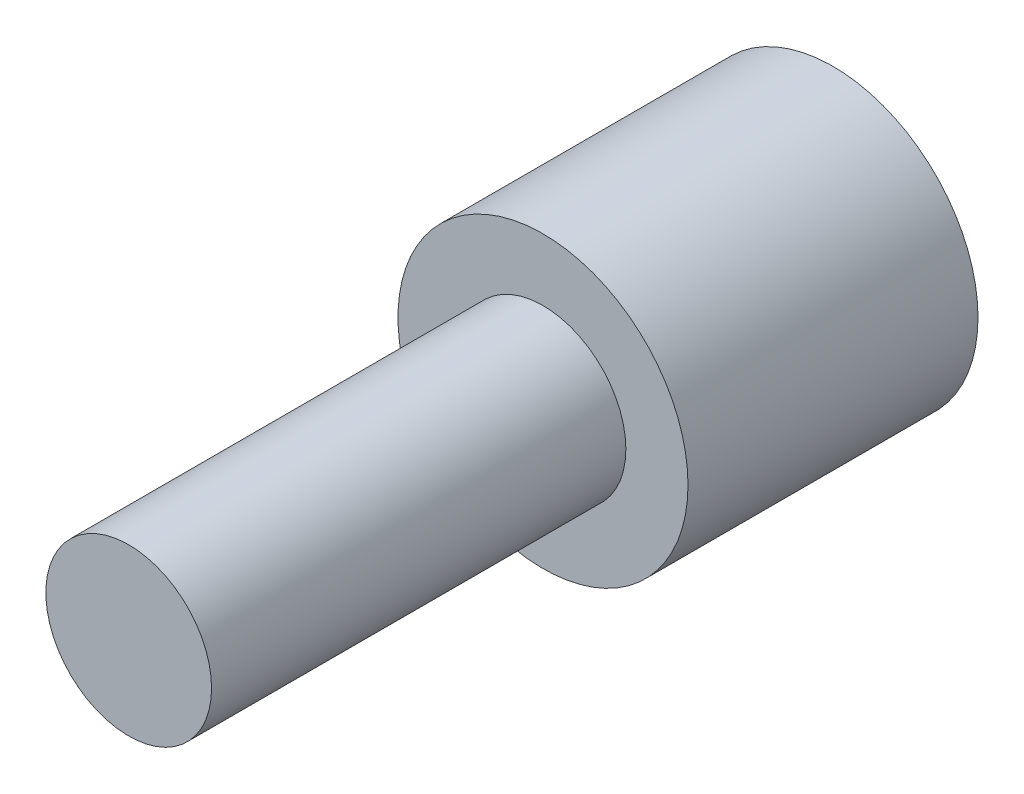
ISO-10303-21;
HEADER;
FILE_DESCRIPTION(('STEP AP214'),'2;1');
FILE_NAME('part.step','',(''),(''),'','','');
FILE_SCHEMA(('AUTOMOTIVE_DESIGN { 1 0 10303 214 1 1 1 1 }'));
ENDSEC;
DATA;
#1=APPLICATION_CONTEXT('core data for automotive mechanical design processes');
#2=APPLICATION_PROTOCOL_DEFINITION('international standard','automotive_design',2000,#1);
#3=PRODUCT_CONTEXT('',#1,'mechanical');
#4=PRODUCT('Part','Part','',(#3));
#5=PRODUCT_RELATED_PRODUCT_CATEGORY('part','',(#4));
#6=PRODUCT_DEFINITION_FORMATION('','',#4);
#7=PRODUCT_DEFINITION_CONTEXT('part definition',#1,'design');
#8=PRODUCT_DEFINITION('design','',#6,#7);
#9=PRODUCT_DEFINITION_SHAPE('','',#8);
#10=(LENGTH_UNIT() NAMED_UNIT(*) SI_UNIT(.MILLI.,.METRE.));
#11=(NAMED_UNIT(*) PLANE_ANGLE_UNIT() SI_UNIT($,.RADIAN.));
#12=(NAMED_UNIT(*) SI_UNIT($,.STERADIAN.) SOLID_ANGLE_UNIT());
#13=UNCERTAINTY_MEASURE_WITH_UNIT(LENGTH_MEASURE(1.E-05),#10,'distance_accuracy_value','');
#14=(GEOMETRIC_REPRESENTATION_CONTEXT(3) GLOBAL_UNCERTAINTY_ASSIGNED_CONTEXT((#13)) GLOBAL_UNIT_ASSIGNED_CONTEXT((#10,
#11,#12)) REPRESENTATION_CONTEXT('',''));
#15=CARTESIAN_POINT('',(0.,0.,0.));
#16=DIRECTION('',(0.,0.,1.));
#17=DIRECTION('',(1.,0.,0.));
#18=AXIS2_PLACEMENT_3D('',#15,#16,#17);
#19=CARTESIAN_POINT('',(0.,0.,7.));
#20=DIRECTION('',(0.,0.,-1.));
#21=DIRECTION('',(-1.,0.,0.));
#22=AXIS2_PLACEMENT_3D('',#19,#20,#21);
#23=CYLINDRICAL_SURFACE('',#22,3.5);
#24=CARTESIAN_POINT('',(0.,0.,7.));
#25=DIRECTION('',(0.,0.,1.));
#26=DIRECTION('',(1.,0.,0.));
#27=AXIS2_PLACEMENT_3D('',#24,#25,#26);
#28=CIRCLE('',#27,3.5);
#29=CARTESIAN_POINT('',(3.5,0.,7.));
#30=VERTEX_POINT('',#29);
#31=EDGE_CURVE('E45',#30,#30,#28,.T.);
#32=ORIENTED_EDGE('',*,*,#31,.F.);
#33=EDGE_LOOP('',(#32));
#34=FACE_BOUND('',#33,.T.);
#35=CARTESIAN_POINT('',(0.,0.,0.));
#36=DIRECTION('',(0.,0.,1.));
#37=DIRECTION('',(1.,0.,0.));
#38=AXIS2_PLACEMENT_3D('',#35,#36,#37);
#39=CIRCLE('',#38,3.5);
#40=CARTESIAN_POINT('',(3.5,0.,0.));
#41=VERTEX_POINT('',#40);
#42=EDGE_CURVE('E40',#41,#41,#39,.T.);
#43=ORIENTED_EDGE('',*,*,#42,.T.);
#44=EDGE_LOOP('',(#43));
#45=FACE_BOUND('',#44,.T.);
#46=ADVANCED_FACE('F37',(#34,#45),#23,.T.);
#47=CARTESIAN_POINT('',(0.,0.,7.));
#48=DIRECTION('',(0.,0.,1.));
#49=DIRECTION('',(1.,0.,0.));
#50=AXIS2_PLACEMENT_3D('',#47,#48,#49);
#51=PLANE('',#50);
#52=CARTESIAN_POINT('',(0.,0.,7.));
#53=DIRECTION('',(0.,0.,1.));
#54=DIRECTION('',(1.,0.,0.));
#55=AXIS2_PLACEMENT_3D('',#52,#53,#54);
#56=CIRCLE('',#55,2.);
#57=CARTESIAN_POINT('',(2.,0.,7.));
#58=VERTEX_POINT('',#57);
#59=EDGE_CURVE('E10',#58,#58,#56,.T.);
#60=ORIENTED_EDGE('',*,*,#59,.F.);
#61=EDGE_LOOP('',(#60));
#62=FACE_BOUND('',#61,.T.);
#63=ORIENTED_EDGE('',*,*,#31,.T.);
#64=EDGE_LOOP('',(#63));
#65=FACE_BOUND('',#64,.T.);
#66=ADVANCED_FACE('F82',(#62,#65),#51,.T.);
#67=CARTESIAN_POINT('',(0.,0.,0.));
#68=DIRECTION('',(0.,0.,1.));
#69=DIRECTION('',(1.,0.,0.));
#70=AXIS2_PLACEMENT_3D('',#67,#68,#69);
#71=PLANE('',#70);
#72=CARTESIAN_POINT('',(0.,0.,0.));
#73=DIRECTION('',(0.,0.,-1.));
#74=DIRECTION('',(-1.,0.,0.));
#75=AXIS2_PLACEMENT_3D('',#72,#73,#74);
#76=CIRCLE('',#75,2.9);
#77=CARTESIAN_POINT('',(-2.9,0.,0.));
#78=VERTEX_POINT('',#77);
#79=EDGE_CURVE('E58',#78,#78,#76,.T.);
#80=ORIENTED_EDGE('',*,*,#79,.F.);
#81=EDGE_LOOP('',(#80));
#82=FACE_BOUND('',#81,.T.);
#83=ORIENTED_EDGE('',*,*,#42,.F.);
#84=EDGE_LOOP('',(#83));
#85=FACE_BOUND('',#84,.T.);
#86=ADVANCED_FACE('F87',(#82,#85),#71,.F.);
#87=CARTESIAN_POINT('',(0.,0.,2.5));
#88=DIRECTION('',(0.,0.,-1.));
#89=DIRECTION('',(-1.,0.,0.));
#90=AXIS2_PLACEMENT_3D('',#87,#88,#89);
#91=CYLINDRICAL_SURFACE('',#90,2.9);
#92=CARTESIAN_POINT('',(0.,0.,2.5));
#93=DIRECTION('',(0.,0.,-1.));
#94=DIRECTION('',(-1.,0.,0.));
#95=AXIS2_PLACEMENT_3D('',#92,#93,#94);
#96=CIRCLE('',#95,2.9);
#97=CARTESIAN_POINT('',(-2.9,0.,2.5));
#98=VERTEX_POINT('',#97);
#99=EDGE_CURVE('E54',#98,#98,#96,.T.);
#100=ORIENTED_EDGE('',*,*,#99,.F.);
#101=EDGE_LOOP('',(#100));
#102=FACE_BOUND('',#101,.T.);
#103=ORIENTED_EDGE('',*,*,#79,.T.);
#104=EDGE_LOOP('',(#103));
#105=FACE_BOUND('',#104,.T.);
#106=ADVANCED_FACE('F78',(#102,#105),#91,.F.);
#107=CARTESIAN_POINT('',(0.,0.,2.5));
#108=DIRECTION('',(0.,0.,-1.));
#109=DIRECTION('',(-1.,0.,0.));
#110=AXIS2_PLACEMENT_3D('',#107,#108,#109);
#111=PLANE('',#110);
#112=ORIENTED_EDGE('',*,*,#99,.T.);
#113=EDGE_LOOP('',(#112));
#114=FACE_BOUND('',#113,.T.);
#115=ADVANCED_FACE('F71',(#114),#111,.T.);
#116=CARTESIAN_POINT('',(0.,0.,17.));
#117=DIRECTION('',(0.,0.,-1.));
#118=DIRECTION('',(-1.,0.,0.));
#119=AXIS2_PLACEMENT_3D('',#116,#117,#118);
#120=CYLINDRICAL_SURFACE('',#119,2.);
#121=CARTESIAN_POINT('',(0.,0.,17.));
#122=DIRECTION('',(0.,0.,1.));
#123=DIRECTION('',(1.,0.,0.));
#124=AXIS2_PLACEMENT_3D('',#121,#122,#123);
#125=CIRCLE('',#124,2.);
#126=CARTESIAN_POINT('',(2.,0.,17.));
#127=VERTEX_POINT('',#126);
#128=EDGE_CURVE('E53',#127,#127,#125,.T.);
#129=ORIENTED_EDGE('',*,*,#128,.F.);
#130=EDGE_LOOP('',(#129));
#131=FACE_BOUND('',#130,.T.);
#132=ORIENTED_EDGE('',*,*,#59,.T.);
#133=EDGE_LOOP('',(#132));
#134=FACE_BOUND('',#133,.T.);
#135=ADVANCED_FACE('F69',(#131,#134),#120,.T.);
#136=CARTESIAN_POINT('',(0.,0.,17.));
#137=DIRECTION('',(0.,0.,1.));
#138=DIRECTION('',(1.,0.,0.));
#139=AXIS2_PLACEMENT_3D('',#136,#137,#138);
#140=PLANE('',#139);
#141=ORIENTED_EDGE('',*,*,#128,.T.);
#142=EDGE_LOOP('',(#141));
#143=FACE_BOUND('',#142,.T.);
#144=ADVANCED_FACE('F67',(#143),#140,.T.);
#145=CLOSED_SHELL('',(#46,#66,#86,#106,#115,#135,#144));
#146=MANIFOLD_SOLID_BREP('B2',#145);
#147=ADVANCED_BREP_SHAPE_REPRESENTATION('',(#18,#146),#14);
#148=SHAPE_DEFINITION_REPRESENTATION(#9,#147);
ENDSEC;
END-ISO-10303-21;
